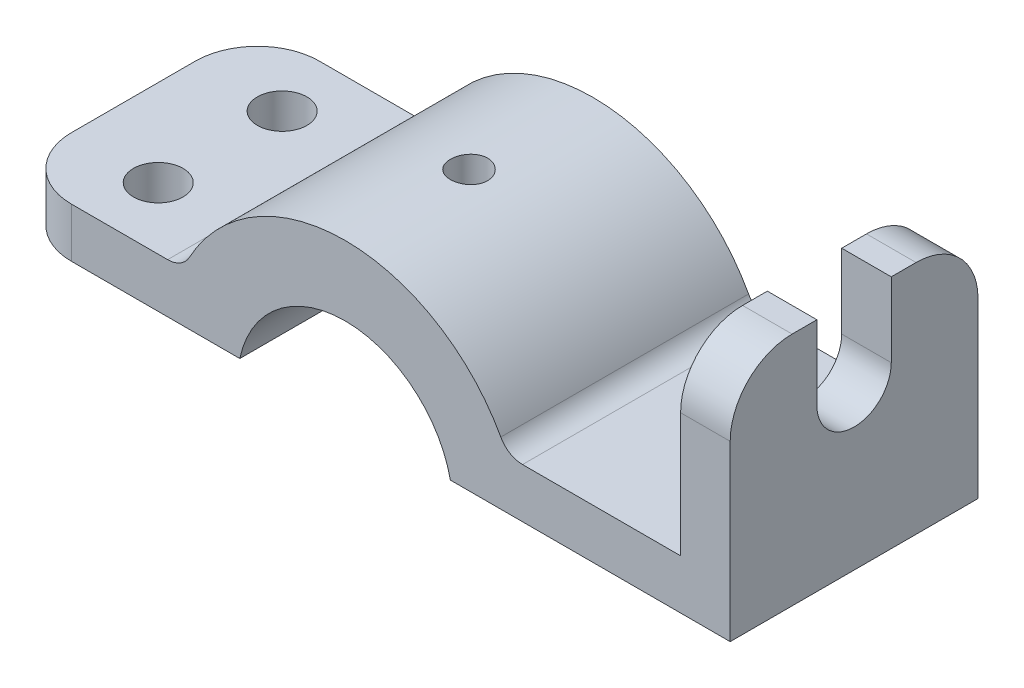
ISO-10303-21;
HEADER;
FILE_DESCRIPTION(('STEP AP214'),'2;1');
FILE_NAME('part.step','',(''),(''),'','','');
FILE_SCHEMA(('AUTOMOTIVE_DESIGN { 1 0 10303 214 1 1 1 1 }'));
ENDSEC;
DATA;
#1=APPLICATION_CONTEXT('core data for automotive mechanical design processes');
#2=APPLICATION_PROTOCOL_DEFINITION('international standard','automotive_design',2000,#1);
#3=PRODUCT_CONTEXT('',#1,'mechanical');
#4=PRODUCT('Part','Part','',(#3));
#5=PRODUCT_RELATED_PRODUCT_CATEGORY('part','',(#4));
#6=PRODUCT_DEFINITION_FORMATION('','',#4);
#7=PRODUCT_DEFINITION_CONTEXT('part definition',#1,'design');
#8=PRODUCT_DEFINITION('design','',#6,#7);
#9=PRODUCT_DEFINITION_SHAPE('','',#8);
#10=(LENGTH_UNIT() NAMED_UNIT(*) SI_UNIT(.MILLI.,.METRE.));
#11=(NAMED_UNIT(*) PLANE_ANGLE_UNIT() SI_UNIT($,.RADIAN.));
#12=(NAMED_UNIT(*) SI_UNIT($,.STERADIAN.) SOLID_ANGLE_UNIT());
#13=UNCERTAINTY_MEASURE_WITH_UNIT(LENGTH_MEASURE(1.E-05),#10,'distance_accuracy_value','');
#14=(GEOMETRIC_REPRESENTATION_CONTEXT(3) GLOBAL_UNCERTAINTY_ASSIGNED_CONTEXT((#13)) GLOBAL_UNIT_ASSIGNED_CONTEXT((#10,
#11,#12)) REPRESENTATION_CONTEXT('',''));
#15=CARTESIAN_POINT('',(0.,0.,0.));
#16=DIRECTION('',(0.,0.,1.));
#17=DIRECTION('',(1.,0.,0.));
#18=AXIS2_PLACEMENT_3D('',#15,#16,#17);
#19=CARTESIAN_POINT('',(27.0793043884528,19.,10.));
#20=DIRECTION('',(0.,-1.,0.));
#21=DIRECTION('',(1.,0.,0.));
#22=AXIS2_PLACEMENT_3D('',#19,#20,#21);
#23=PLANE('',#22);
#24=DIRECTION('',(0.,0.,-1.));
#25=VECTOR('',#24,1.);
#26=CARTESIAN_POINT('',(27.0793043884528,19.,10.));
#27=LINE('',#26,#25);
#28=CARTESIAN_POINT('',(27.0793043884528,19.,-3.));
#29=VERTEX_POINT('',#28);
#30=CARTESIAN_POINT('',(27.0793043884528,19.,-5.));
#31=VERTEX_POINT('',#30);
#32=EDGE_CURVE('E404',#29,#31,#27,.T.);
#33=ORIENTED_EDGE('',*,*,#32,.F.);
#34=DIRECTION('',(1.,0.,0.));
#35=VECTOR('',#34,1.);
#36=CARTESIAN_POINT('',(11.0793043884528,19.,-3.));
#37=LINE('',#36,#35);
#38=CARTESIAN_POINT('',(31.0793043884528,19.,-3.));
#39=VERTEX_POINT('',#38);
#40=EDGE_CURVE('E279',#29,#39,#37,.T.);
#41=ORIENTED_EDGE('',*,*,#40,.T.);
#42=DIRECTION('',(0.,0.,-1.));
#43=VECTOR('',#42,1.);
#44=CARTESIAN_POINT('',(31.0793043884528,19.,10.));
#45=LINE('',#44,#43);
#46=CARTESIAN_POINT('',(31.0793043884528,19.,-5.));
#47=VERTEX_POINT('',#46);
#48=EDGE_CURVE('E201',#39,#47,#45,.T.);
#49=ORIENTED_EDGE('',*,*,#48,.T.);
#50=DIRECTION('',(-1.,0.,0.));
#51=VECTOR('',#50,1.);
#52=CARTESIAN_POINT('',(27.0793043884528,19.,-5.));
#53=LINE('',#52,#51);
#54=EDGE_CURVE('E216',#47,#31,#53,.T.);
#55=ORIENTED_EDGE('',*,*,#54,.T.);
#56=EDGE_LOOP('',(#33,#41,#49,#55));
#57=FACE_BOUND('',#56,.T.);
#58=ADVANCED_FACE('F37',(#57),#23,.F.);
#59=CARTESIAN_POINT('',(0.,-1.80227667711879,10.));
#60=DIRECTION('',(0.,0.,-1.));
#61=DIRECTION('',(-1.,0.,0.));
#62=AXIS2_PLACEMENT_3D('',#59,#60,#61);
#63=CYLINDRICAL_SURFACE('',#62,8.68587793719267);
#64=CARTESIAN_POINT('',(0.,-1.80227667711879,-10.));
#65=DIRECTION('',(0.,0.,-1.));
#66=DIRECTION('',(-1.,0.,0.));
#67=AXIS2_PLACEMENT_3D('',#64,#65,#66);
#68=CIRCLE('',#67,8.68587793719267);
#69=CARTESIAN_POINT('',(-8.49683907808804,0.,-10.));
#70=VERTEX_POINT('',#69);
#71=CARTESIAN_POINT('',(8.49683907808804,0.,-10.));
#72=VERTEX_POINT('',#71);
#73=EDGE_CURVE('E374',#70,#72,#68,.T.);
#74=ORIENTED_EDGE('',*,*,#73,.T.);
#75=DIRECTION('',(0.,0.,-1.));
#76=VECTOR('',#75,1.);
#77=CARTESIAN_POINT('',(8.49683907808804,0.,10.));
#78=LINE('',#77,#76);
#79=CARTESIAN_POINT('',(8.49683907808804,0.,10.));
#80=VERTEX_POINT('',#79);
#81=EDGE_CURVE('E204',#80,#72,#78,.T.);
#82=ORIENTED_EDGE('',*,*,#81,.F.);
#83=CARTESIAN_POINT('',(0.,-1.80227667711879,10.));
#84=DIRECTION('',(0.,0.,-1.));
#85=DIRECTION('',(-1.,0.,0.));
#86=AXIS2_PLACEMENT_3D('',#83,#84,#85);
#87=CIRCLE('',#86,8.68587793719267);
#88=CARTESIAN_POINT('',(-8.49683907808804,0.,10.));
#89=VERTEX_POINT('',#88);
#90=EDGE_CURVE('E419',#89,#80,#87,.T.);
#91=ORIENTED_EDGE('',*,*,#90,.F.);
#92=DIRECTION('',(0.,0.,-1.));
#93=VECTOR('',#92,1.);
#94=CARTESIAN_POINT('',(-8.49683907808804,0.,10.));
#95=LINE('',#94,#93);
#96=EDGE_CURVE('E212',#89,#70,#95,.T.);
#97=ORIENTED_EDGE('',*,*,#96,.T.);
#98=EDGE_LOOP('',(#74,#82,#91,#97));
#99=FACE_BOUND('',#98,.T.);
#100=CARTESIAN_POINT('',(0.,6.88360126007388,-1.5));
#101=CARTESIAN_POINT('',(0.0835893220899221,6.88359979999036,-1.49999668926738));
#102=CARTESIAN_POINT('',(0.167223140486173,6.88238207775664,-1.49298921890085));
#103=CARTESIAN_POINT('',(0.332142027874636,6.87764163222182,-1.4651579116586));
#104=CARTESIAN_POINT('',(0.413424917754952,6.87411683771515,-1.44432165957015));
#105=CARTESIAN_POINT('',(0.571232314451721,6.86515730647574,-1.38948322837258));
#106=CARTESIAN_POINT('',(0.647760764134785,6.85972417789896,-1.35549213242152));
#107=CARTESIAN_POINT('',(0.794019241351104,6.84754422565683,-1.27533861384021));
#108=CARTESIAN_POINT('',(0.863749981717141,6.84079753995877,-1.22917746929064));
#109=CARTESIAN_POINT('',(0.995156202711884,6.82666029277895,-1.12549201321288));
#110=CARTESIAN_POINT('',(1.05675203540625,6.81926439886901,-1.06786747590755));
#111=CARTESIAN_POINT('',(1.16945166534249,6.80470276514919,-0.943106686742903));
#112=CARTESIAN_POINT('',(1.22055477591882,6.79753704042794,-0.875969812862116));
#113=CARTESIAN_POINT('',(1.31114091463413,6.78419539615983,-0.733538568291757));
#114=CARTESIAN_POINT('',(1.35054454895714,6.7780263633847,-0.658193001696359));
#115=CARTESIAN_POINT('',(1.41610535423896,6.76745090863695,-0.501827822833011));
#116=CARTESIAN_POINT('',(1.44226348791448,6.76304435856749,-0.420808623426514));
#117=CARTESIAN_POINT('',(1.48033849512877,6.75654605467474,-0.256242593877711));
#118=CARTESIAN_POINT('',(1.49239327580545,6.75443190026728,-0.17272857226558));
#119=CARTESIAN_POINT('',(1.50234710136601,6.75269006537126,-0.00483852349923678));
#120=CARTESIAN_POINT('',(1.5002472218415,6.75306219595356,0.0795374376709732));
#121=CARTESIAN_POINT('',(1.48206352367446,6.75623044830297,0.245767747578555));
#122=CARTESIAN_POINT('',(1.4661351463884,6.75899962469479,0.327639688444253));
#123=CARTESIAN_POINT('',(1.42099077931151,6.76660773426574,0.48753139127448));
#124=CARTESIAN_POINT('',(1.39177430329521,6.77144674318183,0.565551012162766));
#125=CARTESIAN_POINT('',(1.32072705028178,6.78267813058126,0.715985797223514));
#126=CARTESIAN_POINT('',(1.27883222267814,6.78907836370631,0.788370101051813));
#127=CARTESIAN_POINT('',(1.18366293174346,6.80270567630461,0.925140218341807));
#128=CARTESIAN_POINT('',(1.13038748399372,6.80993282728076,0.989525339115176));
#129=CARTESIAN_POINT('',(1.01312478011645,6.82451778415146,1.10936874715406));
#130=CARTESIAN_POINT('',(0.949004269616386,6.83187604794224,1.16469667661054));
#131=CARTESIAN_POINT('',(0.8123209256665,6.84580528312656,1.26382829885571));
#132=CARTESIAN_POINT('',(0.739758030131746,6.85237624872962,1.3076319068873));
#133=CARTESIAN_POINT('',(0.58812342364745,6.86400088577189,1.38248534881638));
#134=CARTESIAN_POINT('',(0.509045631429531,6.86905311864327,1.41352310087257));
#135=CARTESIAN_POINT('',(0.346692699577572,6.87705962587104,1.46183981693712));
#136=CARTESIAN_POINT('',(0.26341793798963,6.88001408882567,1.47912001782345));
#137=CARTESIAN_POINT('',(0.096157920907219,6.88346665689594,1.49925308324309));
#138=CARTESIAN_POINT('',(0.0121948014565356,6.88399521178424,1.50228480503095));
#139=CARTESIAN_POINT('',(-0.155039330139545,6.88262000721779,1.49431250536416));
#140=CARTESIAN_POINT('',(-0.238310370804291,6.88071634849548,1.48330906518924));
#141=CARTESIAN_POINT('',(-0.401240001530427,6.87470949370694,1.44772754429204));
#142=CARTESIAN_POINT('',(-0.480918626563762,6.87062073864098,1.42323855572818));
#143=CARTESIAN_POINT('',(-0.635039374520593,6.86070026929332,1.36147646379295));
#144=CARTESIAN_POINT('',(-0.709481185351332,6.8548684512407,1.32420259927165));
#145=CARTESIAN_POINT('',(-0.851788316830651,6.84203305449812,1.23752302124764));
#146=CARTESIAN_POINT('',(-0.919585028790406,6.83501894833743,1.18800625814513));
#147=CARTESIAN_POINT('',(-1.04597068813791,6.8206273743297,1.07839854325571));
#148=CARTESIAN_POINT('',(-1.10455891352294,6.81324987805012,1.01830676310376));
#149=CARTESIAN_POINT('',(-1.21153213397233,6.79886383623609,0.888450460923731));
#150=CARTESIAN_POINT('',(-1.25979593643613,6.79186032830822,0.818585455254898));
#151=CARTESIAN_POINT('',(-1.34390230415458,6.77911127705123,0.671634485558874));
#152=CARTESIAN_POINT('',(-1.37974528358488,6.77336569177869,0.594548762417333));
#153=CARTESIAN_POINT('',(-1.43781389322277,6.76382130927795,0.435674722266634));
#154=CARTESIAN_POINT('',(-1.46009851689114,6.76001409005533,0.353908496459172));
#155=CARTESIAN_POINT('',(-1.4906025310399,6.7547568853423,0.187721751971378));
#156=CARTESIAN_POINT('',(-1.49882324376371,6.75330667825388,0.103301483575615));
#157=CARTESIAN_POINT('',(-1.50092713884849,6.75293772294698,-0.0645857865551319));
#158=CARTESIAN_POINT('',(-1.49500118595534,6.75398527509665,-0.148050383327498));
#159=CARTESIAN_POINT('',(-1.46939410969833,6.75841970750833,-0.312775539456748));
#160=CARTESIAN_POINT('',(-1.44971304064617,6.76180657853361,-0.394036107514862));
#161=CARTESIAN_POINT('',(-1.39722962476177,6.7705248376856,-0.551964669371184));
#162=CARTESIAN_POINT('',(-1.36444489364617,6.77585361439453,-0.628638670598465));
#163=CARTESIAN_POINT('',(-1.28670471703669,6.78785758866167,-0.775428899678342));
#164=CARTESIAN_POINT('',(-1.24174859551117,6.79453286100262,-0.845544762983247));
#165=CARTESIAN_POINT('',(-1.14026546362327,6.80858391803249,-0.97819045278852));
#166=CARTESIAN_POINT('',(-1.08359844095466,6.81596753850457,-1.0406123464165));
#167=CARTESIAN_POINT('',(-0.960596541890985,6.83054194488399,-1.15512599688152));
#168=CARTESIAN_POINT('',(-0.89425944158501,6.83773268598158,-1.20721537093715));
#169=CARTESIAN_POINT('',(-0.753209793403192,6.85117363356202,-1.29994348674049));
#170=CARTESIAN_POINT('',(-0.678438371780202,6.85741641146538,-1.34049376770603));
#171=CARTESIAN_POINT('',(-0.523065600959071,6.86818575617221,-1.40839477583377));
#172=CARTESIAN_POINT('',(-0.442470056690122,6.872714004509,-1.43575844305598));
#173=CARTESIAN_POINT('',(-0.301317967655586,6.87857380025267,-1.47067572264514));
#174=CARTESIAN_POINT('',(-0.241607829894058,6.88044886424566,-1.48165439266921));
#175=CARTESIAN_POINT('',(-0.121272924242155,6.8829631119068,-1.49631766198214));
#176=CARTESIAN_POINT('',(-0.0606481740335807,6.88360231943645,-1.50000240209973));
#177=CARTESIAN_POINT('',(0.,6.88360126007388,-1.5));
#178=B_SPLINE_CURVE_WITH_KNOTS('',3,(#100,#101,#102,#103,#104,#105,#106,#107,#108,#109,#110,
#111,#112,#113,#114,#115,#116,#117,#118,#119,#120,#121,#122,#123,#124,#125,#126,#127,#128,#129,
#130,#131,#132,#133,#134,#135,#136,#137,#138,#139,#140,#141,#142,#143,#144,#145,#146,#147,#148,
#149,#150,#151,#152,#153,#154,#155,#156,#157,#158,#159,#160,#161,#162,#163,#164,#165,#166,#167,
#168,#169,#170,#171,#172,#173,#174,#175,#176,#177),.UNSPECIFIED.,.T.,.F.,(4,2,2,2,2,2,2,2,2,2,2,
2,2,2,2,2,2,2,2,2,2,2,2,2,2,2,2,2,2,2,2,2,2,2,2,2,2,2,4),(0.,0.250546250375243,
0.501317741152484,0.751878411440808,1.00241277868901,1.25524233483676,1.50808843140592,
1.76261308381084,2.01711923405947,2.26911537149329,2.52109236033083,2.77027310668614,
3.01946297155984,3.26993336853275,3.52042543986535,3.77425474874328,4.02808592438894,
4.28215678080277,4.53620479229775,4.7870551356331,5.03789509009741,5.28709741513732,
5.53631457905931,5.78788100689462,6.03946714927639,6.29386159720637,6.54824756146937,
6.8015186058331,7.05476583716362,7.30461564577373,7.55446446786422,7.80397853302232,
8.05350645970439,8.30621088075102,8.55897351036379,8.81362464731343,9.06802538296695,
9.24981254917513,9.43159620546405),.UNSPECIFIED.);
#179=CARTESIAN_POINT('',(0.,6.88360126007388,-1.5));
#180=VERTEX_POINT('',#179);
#181=EDGE_CURVE('E278',#180,#180,#178,.T.);
#182=ORIENTED_EDGE('',*,*,#181,.F.);
#183=EDGE_LOOP('',(#182));
#184=FACE_BOUND('',#183,.T.);
#185=ADVANCED_FACE('F305',(#99,#184),#63,.F.);
#186=CARTESIAN_POINT('',(0.,-1.80227667711879,10.));
#187=DIRECTION('',(0.,0.,-1.));
#188=DIRECTION('',(-1.,0.,0.));
#189=AXIS2_PLACEMENT_3D('',#186,#187,#188);
#190=CYLINDRICAL_SURFACE('',#189,14.3085505179119);
#191=CARTESIAN_POINT('',(0.,-1.80227667711879,-10.));
#192=DIRECTION('',(0.,0.,1.));
#193=DIRECTION('',(-1.,0.,0.));
#194=AXIS2_PLACEMENT_3D('',#191,#192,#193);
#195=CIRCLE('',#194,14.3085505179119);
#196=CARTESIAN_POINT('',(12.5648125246957,5.04316736566509,-10.));
#197=VERTEX_POINT('',#196);
#198=CARTESIAN_POINT('',(-12.5648125246957,5.04316736566509,-10.));
#199=VERTEX_POINT('',#198);
#200=EDGE_CURVE('E390',#197,#199,#195,.T.);
#201=ORIENTED_EDGE('',*,*,#200,.T.);
#202=DIRECTION('',(0.,0.,-1.));
#203=VECTOR('',#202,1.);
#204=CARTESIAN_POINT('',(-12.5648125246957,5.04316736566509,10.));
#205=LINE('',#204,#203);
#206=CARTESIAN_POINT('',(-12.5648125246957,5.04316736566509,10.));
#207=VERTEX_POINT('',#206);
#208=EDGE_CURVE('E259',#199,#207,#205,.F.);
#209=ORIENTED_EDGE('',*,*,#208,.T.);
#210=CARTESIAN_POINT('',(0.,-1.80227667711879,10.));
#211=DIRECTION('',(0.,0.,1.));
#212=DIRECTION('',(-1.,0.,0.));
#213=AXIS2_PLACEMENT_3D('',#210,#211,#212);
#214=CIRCLE('',#213,14.3085505179119);
#215=CARTESIAN_POINT('',(12.5648125246957,5.04316736566509,10.));
#216=VERTEX_POINT('',#215);
#217=EDGE_CURVE('E424',#216,#207,#214,.T.);
#218=ORIENTED_EDGE('',*,*,#217,.F.);
#219=DIRECTION('',(0.,0.,-1.));
#220=VECTOR('',#219,1.);
#221=CARTESIAN_POINT('',(12.5648125246957,5.04316736566509,10.));
#222=LINE('',#221,#220);
#223=EDGE_CURVE('E256',#216,#197,#222,.T.);
#224=ORIENTED_EDGE('',*,*,#223,.T.);
#225=EDGE_LOOP('',(#201,#209,#218,#224));
#226=FACE_BOUND('',#225,.T.);
#227=CARTESIAN_POINT('',(0.,12.5062738407931,-1.5));
#228=CARTESIAN_POINT('',(-0.0840083412128405,12.5062728322976,-1.49999637318173));
#229=CARTESIAN_POINT('',(-0.168071689283844,12.5055261431982,-1.49291883134017));
#230=CARTESIAN_POINT('',(-0.333866300573659,12.502619256639,-1.46479283119218));
#231=CARTESIAN_POINT('',(-0.415594916414991,12.5004575162388,-1.44372912232041));
#232=CARTESIAN_POINT('',(-0.574295300907726,12.4949644626079,-1.38825205057435));
#233=CARTESIAN_POINT('',(-0.651269966964931,12.4916338702014,-1.35384691390991));
#234=CARTESIAN_POINT('',(-0.798335686883741,12.4841751794915,-1.27267996545769));
#235=CARTESIAN_POINT('',(-0.868428072625243,12.4800472359546,-1.2259205509977));
#236=CARTESIAN_POINT('',(-1.00003182712098,12.4714378150752,-1.12117503429391));
#237=CARTESIAN_POINT('',(-1.0615122831145,12.4669551501957,-1.06315018673261));
#238=CARTESIAN_POINT('',(-1.17388117551806,12.4581512865245,-0.937603692468063));
#239=CARTESIAN_POINT('',(-1.22476911363764,12.4538300953367,-0.870081599248148));
#240=CARTESIAN_POINT('',(-1.31461906159792,12.4458264050662,-0.727262362595202));
#241=CARTESIAN_POINT('',(-1.3535529036395,12.4421454232353,-0.651947406009124));
#242=CARTESIAN_POINT('',(-1.41820961087621,12.4358538515718,-0.495803683361471));
#243=CARTESIAN_POINT('',(-1.44393283288856,12.4332432328291,-0.414975066289993));
#244=CARTESIAN_POINT('',(-1.48134600869821,12.4293988380326,-0.250414891961257));
#245=CARTESIAN_POINT('',(-1.49308742711615,12.4281600138267,-0.166695155241539));
#246=CARTESIAN_POINT('',(-1.5023628159537,12.4271838480173,0.00153510766836514));
#247=CARTESIAN_POINT('',(-1.49989719450462,12.4274464632814,0.0860456110722498));
#248=CARTESIAN_POINT('',(-1.48087088039496,12.4294388917123,0.25310301937479));
#249=CARTESIAN_POINT('',(-1.46436646690997,12.4311628465174,0.335656413669569));
#250=CARTESIAN_POINT('',(-1.41781867996808,12.4358745606374,0.496815074806064));
#251=CARTESIAN_POINT('',(-1.38777510735941,12.4388623385421,0.575420283553762));
#252=CARTESIAN_POINT('',(-1.31493999588718,12.4457717779775,0.726628524447986));
#253=CARTESIAN_POINT('',(-1.27212357846182,12.4496952590236,0.799219486379916));
#254=CARTESIAN_POINT('',(-1.17497604040732,12.4580325153225,0.93620652914524));
#255=CARTESIAN_POINT('',(-1.12064454924668,12.4624463063503,1.00060234616891));
#256=CARTESIAN_POINT('',(-1.00169523049066,12.4712929574909,1.11969810947444));
#257=CARTESIAN_POINT('',(-0.937028815227877,12.4757258063215,1.17434954040928));
#258=CARTESIAN_POINT('',(-0.799413753991323,12.4840909340443,1.27202884483774));
#259=CARTESIAN_POINT('',(-0.726465097279203,12.4880232122875,1.31505670326056));
#260=CARTESIAN_POINT('',(-0.574322014516227,12.4949456167953,1.38826586164803));
#261=CARTESIAN_POINT('',(-0.49512634612784,12.4979355550639,1.41844459864661));
#262=CARTESIAN_POINT('',(-0.332753612041857,12.5026345211377,1.46506277517723));
#263=CARTESIAN_POINT('',(-0.249576677325003,12.5043435910517,1.4815026663792));
#264=CARTESIAN_POINT('',(-0.0820225260224847,12.5062828345462,1.50011470102586));
#265=CARTESIAN_POINT('',(0.0023471792811988,12.5065199452124,1.50235377152961));
#266=CARTESIAN_POINT('',(0.17026063542149,12.5055071782533,1.49267653588109));
#267=CARTESIAN_POINT('',(0.253804398523061,12.5042573227425,1.48076044024757));
#268=CARTESIAN_POINT('',(0.417500539404691,12.500415481557,1.4431666647457));
#269=CARTESIAN_POINT('',(0.497660215234549,12.4978265624297,1.41752042316595));
#270=CARTESIAN_POINT('',(0.652539852974502,12.4915969228597,1.35322673294805));
#271=CARTESIAN_POINT('',(0.727259681507413,12.4879561766387,1.3145789656618));
#272=CARTESIAN_POINT('',(0.869440553907054,12.4800125869688,1.22521402852891));
#273=CARTESIAN_POINT('',(0.936873899673628,12.4757073584313,1.17445300607624));
#274=CARTESIAN_POINT('',(1.06228699578747,12.4669252679656,1.06236520604548));
#275=CARTESIAN_POINT('',(1.12026648481337,12.4624484012974,1.00103813649943));
#276=CARTESIAN_POINT('',(1.22535932167645,12.453806637265,0.869266567091978));
#277=CARTESIAN_POINT('',(1.27242866605752,12.449643047477,0.798786874889909));
#278=CARTESIAN_POINT('',(1.35406232666953,12.4421194438033,0.650883799826706));
#279=CARTESIAN_POINT('',(1.38862682843267,12.4387594179954,0.573460520007651));
#280=CARTESIAN_POINT('',(1.44419640266923,12.4332316848726,0.414017362505578));
#281=CARTESIAN_POINT('',(1.46522741434948,12.4310616978358,0.332006607557812));
#282=CARTESIAN_POINT('',(1.49321707487784,12.4281527574086,0.165593838776894));
#283=CARTESIAN_POINT('',(1.5001761709719,12.4274137585373,0.0811919010288653));
#284=CARTESIAN_POINT('',(1.49981790029678,12.4274514911176,-0.0871699505250691));
#285=CARTESIAN_POINT('',(1.49256965624182,12.4282208838227,-0.17113002159374));
#286=CARTESIAN_POINT('',(1.46414764183992,12.4311730378326,-0.336632540264602));
#287=CARTESIAN_POINT('',(1.44297385796043,12.4333558005107,-0.418174985517313));
#288=CARTESIAN_POINT('',(1.38732134717064,12.4388866753356,-0.576525497994139));
#289=CARTESIAN_POINT('',(1.35284488488126,12.4422345891198,-0.6533343684727));
#290=CARTESIAN_POINT('',(1.27157271062469,12.4497189301142,-0.800086521840375));
#291=CARTESIAN_POINT('',(1.22477702780807,12.4538553554586,-0.870029820974722));
#292=CARTESIAN_POINT('',(1.1199355972849,12.4624747686951,-1.00141958018742));
#293=CARTESIAN_POINT('',(1.06183830986888,12.4669592854633,-1.06282481562706));
#294=CARTESIAN_POINT('',(0.936146323348751,12.4757556901418,-1.17504412722211));
#295=CARTESIAN_POINT('',(0.868549359506762,12.4800675365713,-1.22585567062966));
#296=CARTESIAN_POINT('',(0.725572165578107,12.4880452129244,-1.3155566593159));
#297=CARTESIAN_POINT('',(0.65017113772471,12.4917092422782,-1.35441309095686));
#298=CARTESIAN_POINT('',(0.4939232849909,12.4979591922399,-1.41886078263906));
#299=CARTESIAN_POINT('',(0.413082676681523,12.5005463200577,-1.44446690419517));
#300=CARTESIAN_POINT('',(0.276492537349509,12.5037055186405,-1.4753468456757));
#301=CARTESIAN_POINT('',(0.221614246763325,12.504664113263,-1.48457903329359));
#302=CARTESIAN_POINT('',(0.111165332014484,12.5059486065695,-1.49690679628013));
#303=CARTESIAN_POINT('',(0.0555947110675956,12.5062745081913,-1.50000240014159));
#304=CARTESIAN_POINT('',(0.,12.5062738407931,-1.5));
#305=B_SPLINE_CURVE_WITH_KNOTS('',3,(#227,#228,#229,#230,#231,#232,#233,#234,#235,#236,#237,
#238,#239,#240,#241,#242,#243,#244,#245,#246,#247,#248,#249,#250,#251,#252,#253,#254,#255,#256,
#257,#258,#259,#260,#261,#262,#263,#264,#265,#266,#267,#268,#269,#270,#271,#272,#273,#274,#275,
#276,#277,#278,#279,#280,#281,#282,#283,#284,#285,#286,#287,#288,#289,#290,#291,#292,#293,#294,
#295,#296,#297,#298,#299,#300,#301,#302,#303,#304),.UNSPECIFIED.,.T.,.F.,(4,2,2,2,2,2,2,2,2,2,2,
2,2,2,2,2,2,2,2,2,2,2,2,2,2,2,2,2,2,2,2,2,2,2,2,2,2,2,4),(0.,0.25182200248148,0.503919044470275,
0.755860892118752,1.00775388671656,1.26052907793975,1.51331615746129,1.76669439475886,
2.02006578798158,2.27250165304665,2.52493026632193,2.77635167890506,3.02777678984613,
3.27969485252836,3.53162102264919,3.78476843964584,4.03791618486478,4.29111440088638,
4.5443042925903,4.79630003321822,5.04829202615666,5.29970947859302,5.55113309334687,
5.80348110618803,6.05583609319389,6.30919183923672,6.56254382612996,6.81540876355431,
7.06826566407746,7.31989539778158,7.57152537601472,7.82311253615856,8.07469910098548,
8.32746109785797,8.5802834561368,8.83379783515879,9.08702725339434,9.25367780582882,
9.42032758448534),.UNSPECIFIED.);
#306=CARTESIAN_POINT('',(0.,12.5062738407931,-1.5));
#307=VERTEX_POINT('',#306);
#308=EDGE_CURVE('E270',#307,#307,#305,.T.);
#309=ORIENTED_EDGE('',*,*,#308,.F.);
#310=EDGE_LOOP('',(#309));
#311=FACE_BOUND('',#310,.T.);
#312=ADVANCED_FACE('F280',(#226,#311),#190,.T.);
#313=CARTESIAN_POINT('',(-27.0793043884528,0.,10.));
#314=DIRECTION('',(0.,1.,0.));
#315=DIRECTION('',(-1.,0.,0.));
#316=AXIS2_PLACEMENT_3D('',#313,#314,#315);
#317=PLANE('',#316);
#318=CARTESIAN_POINT('',(-20.0793043884528,0.,5.));
#319=DIRECTION('',(0.,1.,0.));
#320=DIRECTION('',(-1.,0.,0.));
#321=AXIS2_PLACEMENT_3D('',#318,#319,#320);
#322=CIRCLE('',#321,2.);
#323=CARTESIAN_POINT('',(-22.0793043884528,0.,5.));
#324=VERTEX_POINT('',#323);
#325=EDGE_CURVE('E485',#324,#324,#322,.F.);
#326=ORIENTED_EDGE('',*,*,#325,.F.);
#327=EDGE_LOOP('',(#326));
#328=FACE_BOUND('',#327,.T.);
#329=CARTESIAN_POINT('',(-20.0793043884528,0.,-5.));
#330=DIRECTION('',(0.,1.,0.));
#331=DIRECTION('',(-1.,0.,0.));
#332=AXIS2_PLACEMENT_3D('',#329,#330,#331);
#333=CIRCLE('',#332,2.);
#334=CARTESIAN_POINT('',(-22.0793043884528,0.,-5.));
#335=VERTEX_POINT('',#334);
#336=EDGE_CURVE('E428',#335,#335,#333,.T.);
#337=ORIENTED_EDGE('',*,*,#336,.T.);
#338=EDGE_LOOP('',(#337));
#339=FACE_BOUND('',#338,.T.);
#340=DIRECTION('',(0.,0.,-1.));
#341=VECTOR('',#340,1.);
#342=CARTESIAN_POINT('',(-27.0793043884528,0.,10.));
#343=LINE('',#342,#341);
#344=CARTESIAN_POINT('',(-27.0793043884528,0.,5.));
#345=VERTEX_POINT('',#344);
#346=CARTESIAN_POINT('',(-27.0793043884528,0.,-5.));
#347=VERTEX_POINT('',#346);
#348=EDGE_CURVE('E396',#345,#347,#343,.T.);
#349=ORIENTED_EDGE('',*,*,#348,.T.);
#350=CARTESIAN_POINT('',(-22.0793043884528,0.,-5.));
#351=DIRECTION('',(0.,1.,0.));
#352=DIRECTION('',(-1.,0.,0.));
#353=AXIS2_PLACEMENT_3D('',#350,#351,#352);
#354=CIRCLE('',#353,5.);
#355=CARTESIAN_POINT('',(-22.0793043884528,0.,-10.));
#356=VERTEX_POINT('',#355);
#357=EDGE_CURVE('E240',#347,#356,#354,.F.);
#358=ORIENTED_EDGE('',*,*,#357,.T.);
#359=DIRECTION('',(1.,0.,0.));
#360=VECTOR('',#359,1.);
#361=CARTESIAN_POINT('',(-27.0793043884528,0.,-10.));
#362=LINE('',#361,#360);
#363=EDGE_CURVE('E427',#356,#70,#362,.T.);
#364=ORIENTED_EDGE('',*,*,#363,.T.);
#365=ORIENTED_EDGE('',*,*,#96,.F.);
#366=DIRECTION('',(1.,0.,0.));
#367=VECTOR('',#366,1.);
#368=CARTESIAN_POINT('',(-27.0793043884528,0.,10.));
#369=LINE('',#368,#367);
#370=CARTESIAN_POINT('',(-22.0793043884528,0.,10.));
#371=VERTEX_POINT('',#370);
#372=EDGE_CURVE('E395',#371,#89,#369,.T.);
#373=ORIENTED_EDGE('',*,*,#372,.F.);
#374=CARTESIAN_POINT('',(-22.0793043884528,0.,5.));
#375=DIRECTION('',(0.,1.,0.));
#376=DIRECTION('',(-1.,0.,0.));
#377=AXIS2_PLACEMENT_3D('',#374,#375,#376);
#378=CIRCLE('',#377,5.);
#379=EDGE_CURVE('E238',#371,#345,#378,.F.);
#380=ORIENTED_EDGE('',*,*,#379,.T.);
#381=EDGE_LOOP('',(#349,#358,#364,#365,#373,#380));
#382=FACE_BOUND('',#381,.T.);
#383=ADVANCED_FACE('F313',(#328,#339,#382),#317,.F.);
#384=CARTESIAN_POINT('',(8.49683907808804,0.,10.));
#385=DIRECTION('',(0.,1.,0.));
#386=DIRECTION('',(0.,0.,1.));
#387=AXIS2_PLACEMENT_3D('',#384,#385,#386);
#388=PLANE('',#387);
#389=DIRECTION('',(1.,0.,0.));
#390=VECTOR('',#389,1.);
#391=CARTESIAN_POINT('',(8.49683907808804,0.,-10.));
#392=LINE('',#391,#390);
#393=CARTESIAN_POINT('',(31.0793043884528,0.,-10.));
#394=VERTEX_POINT('',#393);
#395=EDGE_CURVE('E366',#72,#394,#392,.T.);
#396=ORIENTED_EDGE('',*,*,#395,.T.);
#397=DIRECTION('',(0.,0.,-1.));
#398=VECTOR('',#397,1.);
#399=CARTESIAN_POINT('',(31.0793043884528,0.,10.));
#400=LINE('',#399,#398);
#401=CARTESIAN_POINT('',(31.0793043884528,0.,10.));
#402=VERTEX_POINT('',#401);
#403=EDGE_CURVE('E200',#402,#394,#400,.T.);
#404=ORIENTED_EDGE('',*,*,#403,.F.);
#405=DIRECTION('',(1.,0.,0.));
#406=VECTOR('',#405,1.);
#407=CARTESIAN_POINT('',(8.49683907808804,0.,10.));
#408=LINE('',#407,#406);
#409=EDGE_CURVE('E414',#80,#402,#408,.T.);
#410=ORIENTED_EDGE('',*,*,#409,.F.);
#411=ORIENTED_EDGE('',*,*,#81,.T.);
#412=EDGE_LOOP('',(#396,#404,#410,#411));
#413=FACE_BOUND('',#412,.T.);
#414=ADVANCED_FACE('F311',(#413),#388,.F.);
#415=CARTESIAN_POINT('',(31.0793043884528,19.,10.));
#416=DIRECTION('',(-1.,0.,0.));
#417=DIRECTION('',(0.,-1.,0.));
#418=AXIS2_PLACEMENT_3D('',#415,#416,#417);
#419=PLANE('',#418);
#420=ORIENTED_EDGE('',*,*,#48,.F.);
#421=DIRECTION('',(0.,1.,0.));
#422=VECTOR('',#421,1.);
#423=CARTESIAN_POINT('',(31.0793043884528,19.,-3.));
#424=LINE('',#423,#422);
#425=CARTESIAN_POINT('',(31.0793043884528,13.,-3.));
#426=VERTEX_POINT('',#425);
#427=EDGE_CURVE('E185',#426,#39,#424,.T.);
#428=ORIENTED_EDGE('',*,*,#427,.F.);
#429=CARTESIAN_POINT('',(31.0793043884528,13.,0.));
#430=DIRECTION('',(1.,0.,0.));
#431=DIRECTION('',(0.,1.,0.));
#432=AXIS2_PLACEMENT_3D('',#429,#430,#431);
#433=CIRCLE('',#432,3.);
#434=CARTESIAN_POINT('',(31.0793043884528,13.,3.));
#435=VERTEX_POINT('',#434);
#436=EDGE_CURVE('E195',#435,#426,#433,.T.);
#437=ORIENTED_EDGE('',*,*,#436,.F.);
#438=DIRECTION('',(0.,-1.,0.));
#439=VECTOR('',#438,1.);
#440=CARTESIAN_POINT('',(31.0793043884528,19.,3.));
#441=LINE('',#440,#439);
#442=CARTESIAN_POINT('',(31.0793043884528,19.,3.));
#443=VERTEX_POINT('',#442);
#444=EDGE_CURVE('E177',#443,#435,#441,.T.);
#445=ORIENTED_EDGE('',*,*,#444,.F.);
#446=CARTESIAN_POINT('',(31.0793043884528,19.,5.));
#447=VERTEX_POINT('',#446);
#448=EDGE_CURVE('E191',#447,#443,#45,.T.);
#449=ORIENTED_EDGE('',*,*,#448,.F.);
#450=CARTESIAN_POINT('',(31.0793043884528,14.,5.));
#451=DIRECTION('',(-1.,0.,0.));
#452=DIRECTION('',(0.,-1.,0.));
#453=AXIS2_PLACEMENT_3D('',#450,#451,#452);
#454=CIRCLE('',#453,5.);
#455=CARTESIAN_POINT('',(31.0793043884528,14.,10.));
#456=VERTEX_POINT('',#455);
#457=EDGE_CURVE('E225',#447,#456,#454,.F.);
#458=ORIENTED_EDGE('',*,*,#457,.T.);
#459=DIRECTION('',(0.,1.,0.));
#460=VECTOR('',#459,1.);
#461=CARTESIAN_POINT('',(31.0793043884528,19.,10.));
#462=LINE('',#461,#460);
#463=EDGE_CURVE('E379',#402,#456,#462,.T.);
#464=ORIENTED_EDGE('',*,*,#463,.F.);
#465=ORIENTED_EDGE('',*,*,#403,.T.);
#466=DIRECTION('',(0.,1.,0.));
#467=VECTOR('',#466,1.);
#468=CARTESIAN_POINT('',(31.0793043884528,19.,-10.));
#469=LINE('',#468,#467);
#470=CARTESIAN_POINT('',(31.0793043884528,14.,-10.));
#471=VERTEX_POINT('',#470);
#472=EDGE_CURVE('E373',#394,#471,#469,.T.);
#473=ORIENTED_EDGE('',*,*,#472,.T.);
#474=CARTESIAN_POINT('',(31.0793043884528,14.,-5.));
#475=DIRECTION('',(-1.,0.,0.));
#476=DIRECTION('',(0.,-1.,0.));
#477=AXIS2_PLACEMENT_3D('',#474,#475,#476);
#478=CIRCLE('',#477,5.);
#479=EDGE_CURVE('E227',#471,#47,#478,.F.);
#480=ORIENTED_EDGE('',*,*,#479,.T.);
#481=EDGE_LOOP('',(#420,#428,#437,#445,#449,#458,#464,#465,#473,#480));
#482=FACE_BOUND('',#481,.T.);
#483=ADVANCED_FACE('F190',(#482),#419,.F.);
#484=ORIENTED_EDGE('',*,*,#448,.T.);
#485=DIRECTION('',(1.,0.,0.));
#486=VECTOR('',#485,1.);
#487=CARTESIAN_POINT('',(11.0793043884528,19.,3.));
#488=LINE('',#487,#486);
#489=CARTESIAN_POINT('',(27.0793043884528,19.,3.));
#490=VERTEX_POINT('',#489);
#491=EDGE_CURVE('E174',#490,#443,#488,.T.);
#492=ORIENTED_EDGE('',*,*,#491,.F.);
#493=CARTESIAN_POINT('',(27.0793043884528,19.,5.));
#494=VERTEX_POINT('',#493);
#495=EDGE_CURVE('E206',#494,#490,#27,.T.);
#496=ORIENTED_EDGE('',*,*,#495,.F.);
#497=DIRECTION('',(-1.,0.,0.));
#498=VECTOR('',#497,1.);
#499=CARTESIAN_POINT('',(27.0793043884528,19.,5.));
#500=LINE('',#499,#498);
#501=EDGE_CURVE('E199',#494,#447,#500,.F.);
#502=ORIENTED_EDGE('',*,*,#501,.T.);
#503=EDGE_LOOP('',(#484,#492,#496,#502));
#504=FACE_BOUND('',#503,.T.);
#505=ADVANCED_FACE('F197',(#504),#23,.F.);
#506=CARTESIAN_POINT('',(27.0793043884528,4.,10.));
#507=DIRECTION('',(1.,0.,0.));
#508=DIRECTION('',(0.,0.,-1.));
#509=AXIS2_PLACEMENT_3D('',#506,#507,#508);
#510=PLANE('',#509);
#511=CARTESIAN_POINT('',(27.0793043884528,13.,0.));
#512=DIRECTION('',(1.,0.,0.));
#513=DIRECTION('',(0.,0.,-1.));
#514=AXIS2_PLACEMENT_3D('',#511,#512,#513);
#515=CIRCLE('',#514,3.);
#516=CARTESIAN_POINT('',(27.0793043884528,13.,3.));
#517=VERTEX_POINT('',#516);
#518=CARTESIAN_POINT('',(27.0793043884528,13.,-3.));
#519=VERTEX_POINT('',#518);
#520=EDGE_CURVE('E45',#517,#519,#515,.T.);
#521=ORIENTED_EDGE('',*,*,#520,.T.);
#522=DIRECTION('',(0.,1.,0.));
#523=VECTOR('',#522,1.);
#524=CARTESIAN_POINT('',(27.0793043884528,4.,-3.));
#525=LINE('',#524,#523);
#526=EDGE_CURVE('E11',#519,#29,#525,.T.);
#527=ORIENTED_EDGE('',*,*,#526,.T.);
#528=ORIENTED_EDGE('',*,*,#32,.T.);
#529=CARTESIAN_POINT('',(27.0793043884528,14.,-5.));
#530=DIRECTION('',(1.,0.,0.));
#531=DIRECTION('',(0.,0.,-1.));
#532=AXIS2_PLACEMENT_3D('',#529,#530,#531);
#533=CIRCLE('',#532,5.);
#534=CARTESIAN_POINT('',(27.0793043884528,14.,-10.));
#535=VERTEX_POINT('',#534);
#536=EDGE_CURVE('E221',#31,#535,#533,.F.);
#537=ORIENTED_EDGE('',*,*,#536,.T.);
#538=DIRECTION('',(0.,-1.,0.));
#539=VECTOR('',#538,1.);
#540=CARTESIAN_POINT('',(27.0793043884528,4.,-10.));
#541=LINE('',#540,#539);
#542=CARTESIAN_POINT('',(27.0793043884528,4.,-10.));
#543=VERTEX_POINT('',#542);
#544=EDGE_CURVE('E383',#535,#543,#541,.T.);
#545=ORIENTED_EDGE('',*,*,#544,.T.);
#546=DIRECTION('',(0.,0.,-1.));
#547=VECTOR('',#546,1.);
#548=CARTESIAN_POINT('',(27.0793043884528,4.,10.));
#549=LINE('',#548,#547);
#550=CARTESIAN_POINT('',(27.0793043884528,4.,10.));
#551=VERTEX_POINT('',#550);
#552=EDGE_CURVE('E402',#551,#543,#549,.T.);
#553=ORIENTED_EDGE('',*,*,#552,.F.);
#554=DIRECTION('',(0.,-1.,0.));
#555=VECTOR('',#554,1.);
#556=CARTESIAN_POINT('',(27.0793043884528,4.,10.));
#557=LINE('',#556,#555);
#558=CARTESIAN_POINT('',(27.0793043884528,14.,10.));
#559=VERTEX_POINT('',#558);
#560=EDGE_CURVE('E415',#559,#551,#557,.T.);
#561=ORIENTED_EDGE('',*,*,#560,.F.);
#562=CARTESIAN_POINT('',(27.0793043884528,14.,5.));
#563=DIRECTION('',(1.,0.,0.));
#564=DIRECTION('',(0.,0.,-1.));
#565=AXIS2_PLACEMENT_3D('',#562,#563,#564);
#566=CIRCLE('',#565,5.);
#567=EDGE_CURVE('E219',#559,#494,#566,.F.);
#568=ORIENTED_EDGE('',*,*,#567,.T.);
#569=ORIENTED_EDGE('',*,*,#495,.T.);
#570=DIRECTION('',(0.,-1.,0.));
#571=VECTOR('',#570,1.);
#572=CARTESIAN_POINT('',(27.0793043884528,4.,3.));
#573=LINE('',#572,#571);
#574=EDGE_CURVE('E180',#490,#517,#573,.T.);
#575=ORIENTED_EDGE('',*,*,#574,.T.);
#576=EDGE_LOOP('',(#521,#527,#528,#537,#545,#553,#561,#568,#569,#575));
#577=FACE_BOUND('',#576,.T.);
#578=ADVANCED_FACE('F352',(#577),#510,.F.);
#579=CARTESIAN_POINT('',(13.0793043884528,3.99999999999999,10.));
#580=DIRECTION('',(0.,-1.,0.));
#581=DIRECTION('',(1.,0.,0.));
#582=AXIS2_PLACEMENT_3D('',#579,#580,#581);
#583=PLANE('',#582);
#584=DIRECTION('',(-1.,0.,0.));
#585=VECTOR('',#584,1.);
#586=CARTESIAN_POINT('',(13.0793043884528,3.99999999999999,-10.));
#587=LINE('',#586,#585);
#588=CARTESIAN_POINT('',(14.3210788228042,3.99999999999999,-10.));
#589=VERTEX_POINT('',#588);
#590=EDGE_CURVE('E385',#543,#589,#587,.T.);
#591=ORIENTED_EDGE('',*,*,#590,.T.);
#592=DIRECTION('',(0.,0.,1.));
#593=VECTOR('',#592,1.);
#594=CARTESIAN_POINT('',(14.3210788228042,3.99999999999999,10.));
#595=LINE('',#594,#593);
#596=CARTESIAN_POINT('',(14.3210788228042,3.99999999999999,10.));
#597=VERTEX_POINT('',#596);
#598=EDGE_CURVE('E60',#589,#597,#595,.T.);
#599=ORIENTED_EDGE('',*,*,#598,.T.);
#600=DIRECTION('',(-1.,0.,0.));
#601=VECTOR('',#600,1.);
#602=CARTESIAN_POINT('',(13.0793043884528,3.99999999999999,10.));
#603=LINE('',#602,#601);
#604=EDGE_CURVE('E417',#551,#597,#603,.T.);
#605=ORIENTED_EDGE('',*,*,#604,.F.);
#606=ORIENTED_EDGE('',*,*,#552,.T.);
#607=EDGE_LOOP('',(#591,#599,#605,#606));
#608=FACE_BOUND('',#607,.T.);
#609=ADVANCED_FACE('F356',(#608),#583,.F.);
#610=CARTESIAN_POINT('',(-27.0793043884528,3.99999999999999,10.));
#611=DIRECTION('',(0.,-1.,0.));
#612=DIRECTION('',(1.,0.,0.));
#613=AXIS2_PLACEMENT_3D('',#610,#611,#612);
#614=PLANE('',#613);
#615=CARTESIAN_POINT('',(-20.0793043884528,4.,5.));
#616=DIRECTION('',(0.,-1.,0.));
#617=DIRECTION('',(0.,0.,-1.));
#618=AXIS2_PLACEMENT_3D('',#615,#616,#617);
#619=CIRCLE('',#618,2.);
#620=CARTESIAN_POINT('',(-20.0793043884528,4.,3.));
#621=VERTEX_POINT('',#620);
#622=EDGE_CURVE('E302',#621,#621,#619,.T.);
#623=ORIENTED_EDGE('',*,*,#622,.T.);
#624=EDGE_LOOP('',(#623));
#625=FACE_BOUND('',#624,.T.);
#626=CARTESIAN_POINT('',(-20.0793043884528,4.,-5.));
#627=DIRECTION('',(0.,1.,0.));
#628=DIRECTION('',(0.,0.,1.));
#629=AXIS2_PLACEMENT_3D('',#626,#627,#628);
#630=CIRCLE('',#629,2.);
#631=CARTESIAN_POINT('',(-20.0793043884528,4.,-3.));
#632=VERTEX_POINT('',#631);
#633=EDGE_CURVE('E480',#632,#632,#630,.T.);
#634=ORIENTED_EDGE('',*,*,#633,.F.);
#635=EDGE_LOOP('',(#634));
#636=FACE_BOUND('',#635,.T.);
#637=DIRECTION('',(-1.,0.,0.));
#638=VECTOR('',#637,1.);
#639=CARTESIAN_POINT('',(-27.0793043884528,3.99999999999999,10.));
#640=LINE('',#639,#638);
#641=CARTESIAN_POINT('',(-14.3210788228042,4.,10.));
#642=VERTEX_POINT('',#641);
#643=CARTESIAN_POINT('',(-22.0793043884528,3.99999999999999,10.));
#644=VERTEX_POINT('',#643);
#645=EDGE_CURVE('E400',#642,#644,#640,.T.);
#646=ORIENTED_EDGE('',*,*,#645,.F.);
#647=DIRECTION('',(0.,0.,1.));
#648=VECTOR('',#647,1.);
#649=CARTESIAN_POINT('',(-14.3210788228042,4.,-10.));
#650=LINE('',#649,#648);
#651=CARTESIAN_POINT('',(-14.3210788228042,4.,-10.));
#652=VERTEX_POINT('',#651);
#653=EDGE_CURVE('E253',#642,#652,#650,.F.);
#654=ORIENTED_EDGE('',*,*,#653,.T.);
#655=DIRECTION('',(-1.,0.,0.));
#656=VECTOR('',#655,1.);
#657=CARTESIAN_POINT('',(-27.0793043884528,3.99999999999999,-10.));
#658=LINE('',#657,#656);
#659=CARTESIAN_POINT('',(-22.0793043884528,3.99999999999999,-10.));
#660=VERTEX_POINT('',#659);
#661=EDGE_CURVE('E393',#652,#660,#658,.T.);
#662=ORIENTED_EDGE('',*,*,#661,.T.);
#663=CARTESIAN_POINT('',(-22.0793043884528,3.99999999999999,-5.));
#664=DIRECTION('',(0.,-1.,0.));
#665=DIRECTION('',(1.,0.,0.));
#666=AXIS2_PLACEMENT_3D('',#663,#664,#665);
#667=CIRCLE('',#666,5.);
#668=CARTESIAN_POINT('',(-27.0793043884528,3.99999999999999,-5.));
#669=VERTEX_POINT('',#668);
#670=EDGE_CURVE('E248',#660,#669,#667,.F.);
#671=ORIENTED_EDGE('',*,*,#670,.T.);
#672=DIRECTION('',(0.,0.,-1.));
#673=VECTOR('',#672,1.);
#674=CARTESIAN_POINT('',(-27.0793043884528,3.99999999999999,10.));
#675=LINE('',#674,#673);
#676=CARTESIAN_POINT('',(-27.0793043884528,3.99999999999999,5.));
#677=VERTEX_POINT('',#676);
#678=EDGE_CURVE('E399',#677,#669,#675,.T.);
#679=ORIENTED_EDGE('',*,*,#678,.F.);
#680=CARTESIAN_POINT('',(-22.0793043884528,3.99999999999999,5.));
#681=DIRECTION('',(0.,-1.,0.));
#682=DIRECTION('',(1.,0.,0.));
#683=AXIS2_PLACEMENT_3D('',#680,#681,#682);
#684=CIRCLE('',#683,5.);
#685=EDGE_CURVE('E245',#677,#644,#684,.F.);
#686=ORIENTED_EDGE('',*,*,#685,.T.);
#687=EDGE_LOOP('',(#646,#654,#662,#671,#679,#686));
#688=FACE_BOUND('',#687,.T.);
#689=ADVANCED_FACE('F440',(#625,#636,#688),#614,.F.);
#690=CARTESIAN_POINT('',(-27.0793043884528,0.,10.));
#691=DIRECTION('',(1.,0.,0.));
#692=DIRECTION('',(0.,0.,-1.));
#693=AXIS2_PLACEMENT_3D('',#690,#691,#692);
#694=PLANE('',#693);
#695=ORIENTED_EDGE('',*,*,#678,.T.);
#696=DIRECTION('',(0.,-1.,0.));
#697=VECTOR('',#696,1.);
#698=CARTESIAN_POINT('',(-27.0793043884528,0.,-5.));
#699=LINE('',#698,#697);
#700=EDGE_CURVE('E235',#669,#347,#699,.T.);
#701=ORIENTED_EDGE('',*,*,#700,.T.);
#702=ORIENTED_EDGE('',*,*,#348,.F.);
#703=DIRECTION('',(0.,-1.,0.));
#704=VECTOR('',#703,1.);
#705=CARTESIAN_POINT('',(-27.0793043884528,0.,5.));
#706=LINE('',#705,#704);
#707=EDGE_CURVE('E233',#345,#677,#706,.F.);
#708=ORIENTED_EDGE('',*,*,#707,.T.);
#709=EDGE_LOOP('',(#695,#701,#702,#708));
#710=FACE_BOUND('',#709,.T.);
#711=ADVANCED_FACE('F443',(#710),#694,.F.);
#712=CARTESIAN_POINT('',(0.,-1.80227667711879,10.));
#713=DIRECTION('',(0.,0.,-1.));
#714=DIRECTION('',(-1.,0.,0.));
#715=AXIS2_PLACEMENT_3D('',#712,#713,#714);
#716=PLANE('',#715);
#717=ORIENTED_EDGE('',*,*,#217,.T.);
#718=CARTESIAN_POINT('',(-14.3210788228042,6.,10.));
#719=DIRECTION('',(0.,0.,-1.));
#720=DIRECTION('',(-1.,0.,0.));
#721=AXIS2_PLACEMENT_3D('',#718,#719,#720);
#722=CIRCLE('',#721,2.);
#723=EDGE_CURVE('E264',#207,#642,#722,.T.);
#724=ORIENTED_EDGE('',*,*,#723,.T.);
#725=ORIENTED_EDGE('',*,*,#645,.T.);
#726=DIRECTION('',(0.,-1.,0.));
#727=VECTOR('',#726,1.);
#728=CARTESIAN_POINT('',(-22.0793043884528,-1.80227667711879,10.));
#729=LINE('',#728,#727);
#730=EDGE_CURVE('E250',#644,#371,#729,.T.);
#731=ORIENTED_EDGE('',*,*,#730,.T.);
#732=ORIENTED_EDGE('',*,*,#372,.T.);
#733=ORIENTED_EDGE('',*,*,#90,.T.);
#734=ORIENTED_EDGE('',*,*,#409,.T.);
#735=ORIENTED_EDGE('',*,*,#463,.T.);
#736=DIRECTION('',(-1.,0.,0.));
#737=VECTOR('',#736,1.);
#738=CARTESIAN_POINT('',(0.,14.,10.));
#739=LINE('',#738,#737);
#740=EDGE_CURVE('E230',#456,#559,#739,.T.);
#741=ORIENTED_EDGE('',*,*,#740,.T.);
#742=ORIENTED_EDGE('',*,*,#560,.T.);
#743=ORIENTED_EDGE('',*,*,#604,.T.);
#744=CARTESIAN_POINT('',(14.3210788228042,5.99999999999999,10.));
#745=DIRECTION('',(0.,0.,-1.));
#746=DIRECTION('',(-1.,0.,0.));
#747=AXIS2_PLACEMENT_3D('',#744,#745,#746);
#748=CIRCLE('',#747,2.);
#749=EDGE_CURVE('E268',#597,#216,#748,.T.);
#750=ORIENTED_EDGE('',*,*,#749,.T.);
#751=EDGE_LOOP('',(#717,#724,#725,#731,#732,#733,#734,#735,#741,#742,#743,#750));
#752=FACE_BOUND('',#751,.T.);
#753=ADVANCED_FACE('F413',(#752),#716,.F.);
#754=CARTESIAN_POINT('',(0.,-1.80227667711879,-10.));
#755=DIRECTION('',(0.,0.,-1.));
#756=DIRECTION('',(-1.,0.,0.));
#757=AXIS2_PLACEMENT_3D('',#754,#755,#756);
#758=PLANE('',#757);
#759=ORIENTED_EDGE('',*,*,#363,.F.);
#760=DIRECTION('',(0.,-1.,0.));
#761=VECTOR('',#760,1.);
#762=CARTESIAN_POINT('',(-22.0793043884528,3.99999999999999,-10.));
#763=LINE('',#762,#761);
#764=EDGE_CURVE('E242',#356,#660,#763,.F.);
#765=ORIENTED_EDGE('',*,*,#764,.T.);
#766=ORIENTED_EDGE('',*,*,#661,.F.);
#767=CARTESIAN_POINT('',(-14.3210788228042,6.,-10.));
#768=DIRECTION('',(0.,0.,-1.));
#769=DIRECTION('',(-1.,0.,0.));
#770=AXIS2_PLACEMENT_3D('',#767,#768,#769);
#771=CIRCLE('',#770,2.);
#772=EDGE_CURVE('E262',#652,#199,#771,.F.);
#773=ORIENTED_EDGE('',*,*,#772,.T.);
#774=ORIENTED_EDGE('',*,*,#200,.F.);
#775=CARTESIAN_POINT('',(14.3210788228042,5.99999999999999,-10.));
#776=DIRECTION('',(0.,0.,-1.));
#777=DIRECTION('',(-1.,0.,0.));
#778=AXIS2_PLACEMENT_3D('',#775,#776,#777);
#779=CIRCLE('',#778,2.);
#780=EDGE_CURVE('E266',#197,#589,#779,.F.);
#781=ORIENTED_EDGE('',*,*,#780,.T.);
#782=ORIENTED_EDGE('',*,*,#590,.F.);
#783=ORIENTED_EDGE('',*,*,#544,.F.);
#784=DIRECTION('',(-1.,0.,0.));
#785=VECTOR('',#784,1.);
#786=CARTESIAN_POINT('',(31.0793043884528,14.,-10.));
#787=LINE('',#786,#785);
#788=EDGE_CURVE('E223',#535,#471,#787,.F.);
#789=ORIENTED_EDGE('',*,*,#788,.T.);
#790=ORIENTED_EDGE('',*,*,#472,.F.);
#791=ORIENTED_EDGE('',*,*,#395,.F.);
#792=ORIENTED_EDGE('',*,*,#73,.F.);
#793=EDGE_LOOP('',(#759,#765,#766,#773,#774,#781,#782,#783,#789,#790,#791,#792));
#794=FACE_BOUND('',#793,.T.);
#795=ADVANCED_FACE('F321',(#794),#758,.T.);
#796=CARTESIAN_POINT('',(27.0793043884528,14.,-5.));
#797=DIRECTION('',(1.,0.,0.));
#798=DIRECTION('',(0.,1.,0.));
#799=AXIS2_PLACEMENT_3D('',#796,#797,#798);
#800=CYLINDRICAL_SURFACE('',#799,5.);
#801=ORIENTED_EDGE('',*,*,#479,.F.);
#802=ORIENTED_EDGE('',*,*,#788,.F.);
#803=ORIENTED_EDGE('',*,*,#536,.F.);
#804=ORIENTED_EDGE('',*,*,#54,.F.);
#805=EDGE_LOOP('',(#801,#802,#803,#804));
#806=FACE_BOUND('',#805,.T.);
#807=ADVANCED_FACE('F317',(#806),#800,.T.);
#808=CARTESIAN_POINT('',(0.,14.,5.));
#809=DIRECTION('',(-1.,0.,0.));
#810=DIRECTION('',(0.,-1.,0.));
#811=AXIS2_PLACEMENT_3D('',#808,#809,#810);
#812=CYLINDRICAL_SURFACE('',#811,5.);
#813=ORIENTED_EDGE('',*,*,#457,.F.);
#814=ORIENTED_EDGE('',*,*,#501,.F.);
#815=ORIENTED_EDGE('',*,*,#567,.F.);
#816=ORIENTED_EDGE('',*,*,#740,.F.);
#817=EDGE_LOOP('',(#813,#814,#815,#816));
#818=FACE_BOUND('',#817,.T.);
#819=ADVANCED_FACE('F320',(#818),#812,.T.);
#820=CARTESIAN_POINT('',(-22.0793043884528,0.,-5.));
#821=DIRECTION('',(0.,1.,0.));
#822=DIRECTION('',(0.,0.,1.));
#823=AXIS2_PLACEMENT_3D('',#820,#821,#822);
#824=CYLINDRICAL_SURFACE('',#823,5.);
#825=ORIENTED_EDGE('',*,*,#670,.F.);
#826=ORIENTED_EDGE('',*,*,#764,.F.);
#827=ORIENTED_EDGE('',*,*,#357,.F.);
#828=ORIENTED_EDGE('',*,*,#700,.F.);
#829=EDGE_LOOP('',(#825,#826,#827,#828));
#830=FACE_BOUND('',#829,.T.);
#831=ADVANCED_FACE('F325',(#830),#824,.T.);
#832=CARTESIAN_POINT('',(-22.0793043884528,-1.80227667711879,5.));
#833=DIRECTION('',(0.,-1.,0.));
#834=DIRECTION('',(0.,0.,-1.));
#835=AXIS2_PLACEMENT_3D('',#832,#833,#834);
#836=CYLINDRICAL_SURFACE('',#835,5.);
#837=ORIENTED_EDGE('',*,*,#685,.F.);
#838=ORIENTED_EDGE('',*,*,#707,.F.);
#839=ORIENTED_EDGE('',*,*,#379,.F.);
#840=ORIENTED_EDGE('',*,*,#730,.F.);
#841=EDGE_LOOP('',(#837,#838,#839,#840));
#842=FACE_BOUND('',#841,.T.);
#843=ADVANCED_FACE('F329',(#842),#836,.T.);
#844=CARTESIAN_POINT('',(-14.3210788228042,6.,10.));
#845=DIRECTION('',(0.,0.,-1.));
#846=DIRECTION('',(-1.,0.,0.));
#847=AXIS2_PLACEMENT_3D('',#844,#845,#846);
#848=CYLINDRICAL_SURFACE('',#847,2.);
#849=ORIENTED_EDGE('',*,*,#723,.F.);
#850=ORIENTED_EDGE('',*,*,#208,.F.);
#851=ORIENTED_EDGE('',*,*,#772,.F.);
#852=ORIENTED_EDGE('',*,*,#653,.F.);
#853=EDGE_LOOP('',(#849,#850,#851,#852));
#854=FACE_BOUND('',#853,.T.);
#855=ADVANCED_FACE('F332',(#854),#848,.F.);
#856=CARTESIAN_POINT('',(14.3210788228042,5.99999999999999,10.));
#857=DIRECTION('',(0.,0.,-1.));
#858=DIRECTION('',(-1.,0.,0.));
#859=AXIS2_PLACEMENT_3D('',#856,#857,#858);
#860=CYLINDRICAL_SURFACE('',#859,2.);
#861=ORIENTED_EDGE('',*,*,#749,.F.);
#862=ORIENTED_EDGE('',*,*,#598,.F.);
#863=ORIENTED_EDGE('',*,*,#780,.F.);
#864=ORIENTED_EDGE('',*,*,#223,.F.);
#865=EDGE_LOOP('',(#861,#862,#863,#864));
#866=FACE_BOUND('',#865,.T.);
#867=ADVANCED_FACE('F39',(#866),#860,.F.);
#868=CARTESIAN_POINT('',(-20.0793043884528,-16.,-5.));
#869=DIRECTION('',(0.,1.,0.));
#870=DIRECTION('',(0.,0.,1.));
#871=AXIS2_PLACEMENT_3D('',#868,#869,#870);
#872=CYLINDRICAL_SURFACE('',#871,2.);
#873=ORIENTED_EDGE('',*,*,#633,.T.);
#874=EDGE_LOOP('',(#873));
#875=FACE_BOUND('',#874,.T.);
#876=ORIENTED_EDGE('',*,*,#336,.F.);
#877=EDGE_LOOP('',(#876));
#878=FACE_BOUND('',#877,.T.);
#879=ADVANCED_FACE('F339',(#875,#878),#872,.F.);
#880=CARTESIAN_POINT('',(-20.0793043884528,-16.,5.));
#881=DIRECTION('',(0.,1.,0.));
#882=DIRECTION('',(0.,0.,1.));
#883=AXIS2_PLACEMENT_3D('',#880,#881,#882);
#884=CYLINDRICAL_SURFACE('',#883,2.);
#885=ORIENTED_EDGE('',*,*,#622,.F.);
#886=EDGE_LOOP('',(#885));
#887=FACE_BOUND('',#886,.T.);
#888=ORIENTED_EDGE('',*,*,#325,.T.);
#889=EDGE_LOOP('',(#888));
#890=FACE_BOUND('',#889,.T.);
#891=ADVANCED_FACE('F290',(#887,#890),#884,.F.);
#892=CARTESIAN_POINT('',(0.,20.,0.));
#893=DIRECTION('',(0.,-1.,0.));
#894=DIRECTION('',(0.,0.,-1.));
#895=AXIS2_PLACEMENT_3D('',#892,#893,#894);
#896=CYLINDRICAL_SURFACE('',#895,1.5);
#897=ORIENTED_EDGE('',*,*,#308,.T.);
#898=EDGE_LOOP('',(#897));
#899=FACE_BOUND('',#898,.T.);
#900=ORIENTED_EDGE('',*,*,#181,.T.);
#901=EDGE_LOOP('',(#900));
#902=FACE_BOUND('',#901,.T.);
#903=ADVANCED_FACE('F284',(#899,#902),#896,.F.);
#904=CARTESIAN_POINT('',(11.0793043884528,19.,-3.));
#905=DIRECTION('',(0.,0.,-1.));
#906=DIRECTION('',(0.,1.,0.));
#907=AXIS2_PLACEMENT_3D('',#904,#905,#906);
#908=PLANE('',#907);
#909=DIRECTION('',(1.,0.,0.));
#910=VECTOR('',#909,1.);
#911=CARTESIAN_POINT('',(11.0793043884528,13.,-3.));
#912=LINE('',#911,#910);
#913=EDGE_CURVE('E684',#519,#426,#912,.T.);
#914=ORIENTED_EDGE('',*,*,#913,.T.);
#915=ORIENTED_EDGE('',*,*,#427,.T.);
#916=ORIENTED_EDGE('',*,*,#40,.F.);
#917=ORIENTED_EDGE('',*,*,#526,.F.);
#918=EDGE_LOOP('',(#914,#915,#916,#917));
#919=FACE_BOUND('',#918,.T.);
#920=ADVANCED_FACE('F289',(#919),#908,.F.);
#921=CARTESIAN_POINT('',(11.0793043884528,13.,0.));
#922=DIRECTION('',(1.,0.,0.));
#923=DIRECTION('',(0.,1.,0.));
#924=AXIS2_PLACEMENT_3D('',#921,#922,#923);
#925=CYLINDRICAL_SURFACE('',#924,3.);
#926=DIRECTION('',(1.,0.,0.));
#927=VECTOR('',#926,1.);
#928=CARTESIAN_POINT('',(11.0793043884528,13.,3.));
#929=LINE('',#928,#927);
#930=EDGE_CURVE('E52',#517,#435,#929,.T.);
#931=ORIENTED_EDGE('',*,*,#930,.T.);
#932=ORIENTED_EDGE('',*,*,#436,.T.);
#933=ORIENTED_EDGE('',*,*,#913,.F.);
#934=ORIENTED_EDGE('',*,*,#520,.F.);
#935=EDGE_LOOP('',(#931,#932,#933,#934));
#936=FACE_BOUND('',#935,.T.);
#937=ADVANCED_FACE('F523',(#936),#925,.F.);
#938=CARTESIAN_POINT('',(11.0793043884528,19.,3.));
#939=DIRECTION('',(0.,0.,1.));
#940=DIRECTION('',(0.,-1.,0.));
#941=AXIS2_PLACEMENT_3D('',#938,#939,#940);
#942=PLANE('',#941);
#943=ORIENTED_EDGE('',*,*,#491,.T.);
#944=ORIENTED_EDGE('',*,*,#444,.T.);
#945=ORIENTED_EDGE('',*,*,#930,.F.);
#946=ORIENTED_EDGE('',*,*,#574,.F.);
#947=EDGE_LOOP('',(#943,#944,#945,#946));
#948=FACE_BOUND('',#947,.T.);
#949=ADVANCED_FACE('F176',(#948),#942,.F.);
#950=CLOSED_SHELL('',(#58,#185,#312,#383,#414,#483,#505,#578,#609,#689,#711,#753,#795,#807,#819,
#831,#843,#855,#867,#879,#891,#903,#920,#937,#949));
#951=MANIFOLD_SOLID_BREP('B2',#950);
#952=ADVANCED_BREP_SHAPE_REPRESENTATION('',(#18,#951),#14);
#953=SHAPE_DEFINITION_REPRESENTATION(#9,#952);
ENDSEC;
END-ISO-10303-21;
